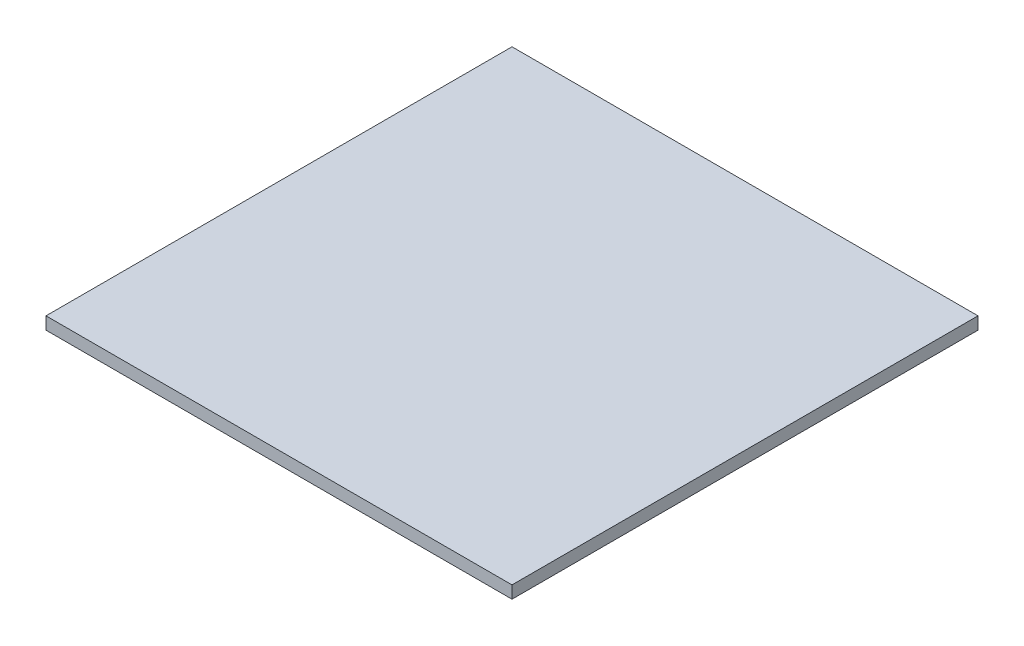
ISO-10303-21;
HEADER;
FILE_DESCRIPTION(('STEP AP214'),'2;1');
FILE_NAME('part.step','',(''),(''),'','','');
FILE_SCHEMA(('AUTOMOTIVE_DESIGN { 1 0 10303 214 1 1 1 1 }'));
ENDSEC;
DATA;
#1=APPLICATION_CONTEXT('core data for automotive mechanical design processes');
#2=APPLICATION_PROTOCOL_DEFINITION('international standard','automotive_design',2000,#1);
#3=PRODUCT_CONTEXT('',#1,'mechanical');
#4=PRODUCT('Part','Part','',(#3));
#5=PRODUCT_RELATED_PRODUCT_CATEGORY('part','',(#4));
#6=PRODUCT_DEFINITION_FORMATION('','',#4);
#7=PRODUCT_DEFINITION_CONTEXT('part definition',#1,'design');
#8=PRODUCT_DEFINITION('design','',#6,#7);
#9=PRODUCT_DEFINITION_SHAPE('','',#8);
#10=(LENGTH_UNIT() NAMED_UNIT(*) SI_UNIT(.MILLI.,.METRE.));
#11=(NAMED_UNIT(*) PLANE_ANGLE_UNIT() SI_UNIT($,.RADIAN.));
#12=(NAMED_UNIT(*) SI_UNIT($,.STERADIAN.) SOLID_ANGLE_UNIT());
#13=UNCERTAINTY_MEASURE_WITH_UNIT(LENGTH_MEASURE(1.E-05),#10,'distance_accuracy_value','');
#14=(GEOMETRIC_REPRESENTATION_CONTEXT(3) GLOBAL_UNCERTAINTY_ASSIGNED_CONTEXT((#13)) GLOBAL_UNIT_ASSIGNED_CONTEXT((#10,
#11,#12)) REPRESENTATION_CONTEXT('',''));
#15=CARTESIAN_POINT('',(0.,0.,0.));
#16=DIRECTION('',(0.,0.,1.));
#17=DIRECTION('',(1.,0.,0.));
#18=AXIS2_PLACEMENT_3D('',#15,#16,#17);
#19=CARTESIAN_POINT('',(50.,4.,0.));
#20=DIRECTION('',(-1.,0.,0.));
#21=DIRECTION('',(0.,0.,1.));
#22=AXIS2_PLACEMENT_3D('',#19,#20,#21);
#23=PLANE('',#22);
#24=DIRECTION('',(0.,1.,0.));
#25=VECTOR('',#24,1.);
#26=CARTESIAN_POINT('',(50.,4.,-195.));
#27=LINE('',#26,#25);
#28=CARTESIAN_POINT('',(50.,4.,-195.));
#29=VERTEX_POINT('',#28);
#30=CARTESIAN_POINT('',(50.,8.,-195.));
#31=VERTEX_POINT('',#30);
#32=EDGE_CURVE('E11',#29,#31,#27,.T.);
#33=ORIENTED_EDGE('',*,*,#32,.F.);
#34=DIRECTION('',(0.,0.,1.));
#35=VECTOR('',#34,1.);
#36=CARTESIAN_POINT('',(50.,4.,0.));
#37=LINE('',#36,#35);
#38=CARTESIAN_POINT('',(50.0000000000001,4.,-45.0000000000001));
#39=VERTEX_POINT('',#38);
#40=EDGE_CURVE('E89',#29,#39,#37,.T.);
#41=ORIENTED_EDGE('',*,*,#40,.T.);
#42=DIRECTION('',(0.,1.,0.));
#43=VECTOR('',#42,1.);
#44=CARTESIAN_POINT('',(50.0000000000001,4.,-45.0000000000001));
#45=LINE('',#44,#43);
#46=CARTESIAN_POINT('',(50.0000000000001,8.,-45.0000000000001));
#47=VERTEX_POINT('',#46);
#48=EDGE_CURVE('E44',#39,#47,#45,.T.);
#49=ORIENTED_EDGE('',*,*,#48,.T.);
#50=DIRECTION('',(0.,0.,1.));
#51=VECTOR('',#50,1.);
#52=CARTESIAN_POINT('',(50.,8.,0.));
#53=LINE('',#52,#51);
#54=EDGE_CURVE('E102',#31,#47,#53,.T.);
#55=ORIENTED_EDGE('',*,*,#54,.F.);
#56=EDGE_LOOP('',(#33,#41,#49,#55));
#57=FACE_BOUND('',#56,.T.);
#58=ADVANCED_FACE('F34',(#57),#23,.T.);
#59=CARTESIAN_POINT('',(0.,4.,-45.0000000000001));
#60=DIRECTION('',(0.,0.,1.));
#61=DIRECTION('',(1.,0.,0.));
#62=AXIS2_PLACEMENT_3D('',#59,#60,#61);
#63=PLANE('',#62);
#64=ORIENTED_EDGE('',*,*,#48,.F.);
#65=DIRECTION('',(1.,0.,0.));
#66=VECTOR('',#65,1.);
#67=CARTESIAN_POINT('',(0.,4.,-45.0000000000001));
#68=LINE('',#67,#66);
#69=CARTESIAN_POINT('',(200.,4.,-45.0000000000001));
#70=VERTEX_POINT('',#69);
#71=EDGE_CURVE('E96',#70,#39,#68,.F.);
#72=ORIENTED_EDGE('',*,*,#71,.F.);
#73=DIRECTION('',(0.,1.,0.));
#74=VECTOR('',#73,1.);
#75=CARTESIAN_POINT('',(200.,4.,-45.0000000000001));
#76=LINE('',#75,#74);
#77=CARTESIAN_POINT('',(200.,8.,-45.0000000000001));
#78=VERTEX_POINT('',#77);
#79=EDGE_CURVE('E52',#70,#78,#76,.T.);
#80=ORIENTED_EDGE('',*,*,#79,.T.);
#81=DIRECTION('',(1.,0.,0.));
#82=VECTOR('',#81,1.);
#83=CARTESIAN_POINT('',(0.,8.,-45.0000000000001));
#84=LINE('',#83,#82);
#85=EDGE_CURVE('E83',#78,#47,#84,.F.);
#86=ORIENTED_EDGE('',*,*,#85,.T.);
#87=EDGE_LOOP('',(#64,#72,#80,#86));
#88=FACE_BOUND('',#87,.T.);
#89=ADVANCED_FACE('F106',(#88),#63,.T.);
#90=CARTESIAN_POINT('',(200.,4.,0.));
#91=DIRECTION('',(-1.,0.,0.));
#92=DIRECTION('',(0.,0.,1.));
#93=AXIS2_PLACEMENT_3D('',#90,#91,#92);
#94=PLANE('',#93);
#95=ORIENTED_EDGE('',*,*,#79,.F.);
#96=DIRECTION('',(0.,0.,1.));
#97=VECTOR('',#96,1.);
#98=CARTESIAN_POINT('',(200.,4.,0.));
#99=LINE('',#98,#97);
#100=CARTESIAN_POINT('',(200.,4.,-195.));
#101=VERTEX_POINT('',#100);
#102=EDGE_CURVE('E88',#70,#101,#99,.F.);
#103=ORIENTED_EDGE('',*,*,#102,.T.);
#104=DIRECTION('',(0.,1.,0.));
#105=VECTOR('',#104,1.);
#106=CARTESIAN_POINT('',(200.,4.,-195.));
#107=LINE('',#106,#105);
#108=CARTESIAN_POINT('',(200.,8.,-195.));
#109=VERTEX_POINT('',#108);
#110=EDGE_CURVE('E38',#101,#109,#107,.T.);
#111=ORIENTED_EDGE('',*,*,#110,.T.);
#112=DIRECTION('',(0.,0.,1.));
#113=VECTOR('',#112,1.);
#114=CARTESIAN_POINT('',(200.,8.,0.));
#115=LINE('',#114,#113);
#116=EDGE_CURVE('E98',#78,#109,#115,.F.);
#117=ORIENTED_EDGE('',*,*,#116,.F.);
#118=EDGE_LOOP('',(#95,#103,#111,#117));
#119=FACE_BOUND('',#118,.T.);
#120=ADVANCED_FACE('F91',(#119),#94,.F.);
#121=CARTESIAN_POINT('',(0.,4.,-195.));
#122=DIRECTION('',(0.,0.,1.));
#123=DIRECTION('',(1.,0.,0.));
#124=AXIS2_PLACEMENT_3D('',#121,#122,#123);
#125=PLANE('',#124);
#126=DIRECTION('',(1.,0.,0.));
#127=VECTOR('',#126,1.);
#128=CARTESIAN_POINT('',(0.,4.,-195.));
#129=LINE('',#128,#127);
#130=EDGE_CURVE('E77',#101,#29,#129,.F.);
#131=ORIENTED_EDGE('',*,*,#130,.T.);
#132=ORIENTED_EDGE('',*,*,#32,.T.);
#133=DIRECTION('',(1.,0.,0.));
#134=VECTOR('',#133,1.);
#135=CARTESIAN_POINT('',(0.,8.,-195.));
#136=LINE('',#135,#134);
#137=EDGE_CURVE('E79',#109,#31,#136,.F.);
#138=ORIENTED_EDGE('',*,*,#137,.F.);
#139=ORIENTED_EDGE('',*,*,#110,.F.);
#140=EDGE_LOOP('',(#131,#132,#138,#139));
#141=FACE_BOUND('',#140,.T.);
#142=ADVANCED_FACE('F36',(#141),#125,.F.);
#143=CARTESIAN_POINT('',(0.,8.,0.));
#144=DIRECTION('',(0.,1.,0.));
#145=DIRECTION('',(0.,0.,1.));
#146=AXIS2_PLACEMENT_3D('',#143,#144,#145);
#147=PLANE('',#146);
#148=ORIENTED_EDGE('',*,*,#116,.T.);
#149=ORIENTED_EDGE('',*,*,#137,.T.);
#150=ORIENTED_EDGE('',*,*,#54,.T.);
#151=ORIENTED_EDGE('',*,*,#85,.F.);
#152=EDGE_LOOP('',(#148,#149,#150,#151));
#153=FACE_BOUND('',#152,.T.);
#154=ADVANCED_FACE('F105',(#153),#147,.T.);
#155=CARTESIAN_POINT('',(0.,4.,0.));
#156=DIRECTION('',(0.,1.,0.));
#157=DIRECTION('',(0.,0.,1.));
#158=AXIS2_PLACEMENT_3D('',#155,#156,#157);
#159=PLANE('',#158);
#160=ORIENTED_EDGE('',*,*,#102,.F.);
#161=ORIENTED_EDGE('',*,*,#71,.T.);
#162=ORIENTED_EDGE('',*,*,#40,.F.);
#163=ORIENTED_EDGE('',*,*,#130,.F.);
#164=EDGE_LOOP('',(#160,#161,#162,#163));
#165=FACE_BOUND('',#164,.T.);
#166=ADVANCED_FACE('F86',(#165),#159,.F.);
#167=CLOSED_SHELL('',(#58,#89,#120,#142,#154,#166));
#168=MANIFOLD_SOLID_BREP('B2',#167);
#169=ADVANCED_BREP_SHAPE_REPRESENTATION('',(#18,#168),#14);
#170=SHAPE_DEFINITION_REPRESENTATION(#9,#169);
ENDSEC;
END-ISO-10303-21;
